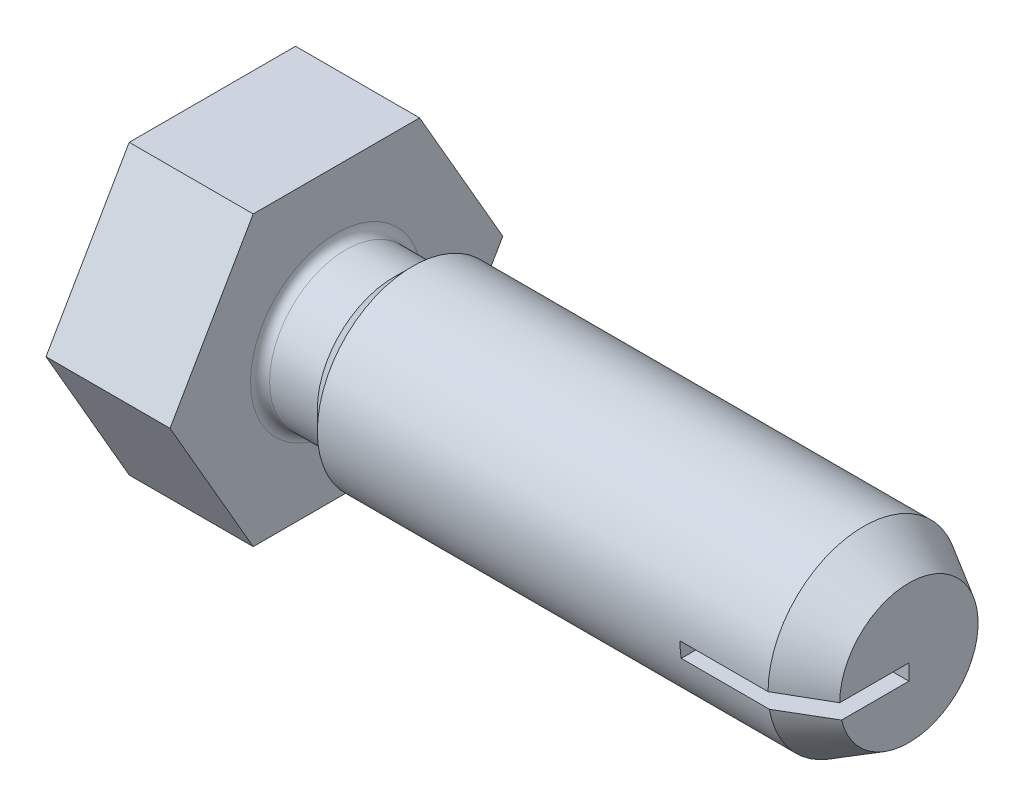
ISO-10303-21;
HEADER;
FILE_DESCRIPTION(('STEP AP214'),'2;1');
FILE_NAME('part.step','',(''),(''),'','','');
FILE_SCHEMA(('AUTOMOTIVE_DESIGN { 1 0 10303 214 1 1 1 1 }'));
ENDSEC;
DATA;
#1=APPLICATION_CONTEXT('core data for automotive mechanical design processes');
#2=APPLICATION_PROTOCOL_DEFINITION('international standard','automotive_design',2000,#1);
#3=PRODUCT_CONTEXT('',#1,'mechanical');
#4=PRODUCT('Part','Part','',(#3));
#5=PRODUCT_RELATED_PRODUCT_CATEGORY('part','',(#4));
#6=PRODUCT_DEFINITION_FORMATION('','',#4);
#7=PRODUCT_DEFINITION_CONTEXT('part definition',#1,'design');
#8=PRODUCT_DEFINITION('design','',#6,#7);
#9=PRODUCT_DEFINITION_SHAPE('','',#8);
#10=(LENGTH_UNIT() NAMED_UNIT(*) SI_UNIT(.MILLI.,.METRE.));
#11=(NAMED_UNIT(*) PLANE_ANGLE_UNIT() SI_UNIT($,.RADIAN.));
#12=(NAMED_UNIT(*) SI_UNIT($,.STERADIAN.) SOLID_ANGLE_UNIT());
#13=UNCERTAINTY_MEASURE_WITH_UNIT(LENGTH_MEASURE(1.E-05),#10,'distance_accuracy_value','');
#14=(GEOMETRIC_REPRESENTATION_CONTEXT(3) GLOBAL_UNCERTAINTY_ASSIGNED_CONTEXT((#13)) GLOBAL_UNIT_ASSIGNED_CONTEXT((#10,
#11,#12)) REPRESENTATION_CONTEXT('',''));
#15=CARTESIAN_POINT('',(0.,0.,0.));
#16=DIRECTION('',(0.,0.,1.));
#17=DIRECTION('',(1.,0.,0.));
#18=AXIS2_PLACEMENT_3D('',#15,#16,#17);
#19=CARTESIAN_POINT('',(0.,0.,0.));
#20=DIRECTION('',(-1.,0.,0.));
#21=DIRECTION('',(0.,0.,1.));
#22=AXIS2_PLACEMENT_3D('',#19,#20,#21);
#23=CYLINDRICAL_SURFACE('',#22,1.);
#24=CARTESIAN_POINT('',(0.8,0.,0.));
#25=DIRECTION('',(-1.,0.,0.));
#26=DIRECTION('',(0.,0.,1.));
#27=AXIS2_PLACEMENT_3D('',#24,#25,#26);
#28=CIRCLE('',#27,1.);
#29=CARTESIAN_POINT('',(0.8,0.,1.));
#30=VERTEX_POINT('',#29);
#31=EDGE_CURVE('E233',#30,#30,#28,.T.);
#32=ORIENTED_EDGE('',*,*,#31,.F.);
#33=EDGE_LOOP('',(#32));
#34=FACE_BOUND('',#33,.T.);
#35=DIRECTION('',(-1.,0.,0.));
#36=VECTOR('',#35,1.);
#37=CARTESIAN_POINT('',(0.,0.,1.));
#38=LINE('',#37,#36);
#39=CARTESIAN_POINT('',(5.52368602791855,0.,1.));
#40=VERTEX_POINT('',#39);
#41=CARTESIAN_POINT('',(4.6,0.,1.));
#42=VERTEX_POINT('',#41);
#43=EDGE_CURVE('E266',#40,#42,#38,.T.);
#44=ORIENTED_EDGE('',*,*,#43,.F.);
#45=CARTESIAN_POINT('',(5.52368602791855,0.,0.));
#46=DIRECTION('',(-1.,0.,0.));
#47=DIRECTION('',(0.,0.,1.));
#48=AXIS2_PLACEMENT_3D('',#45,#46,#47);
#49=CIRCLE('',#48,1.);
#50=CARTESIAN_POINT('',(5.52368602791855,-0.166666666666667,0.986013297183269));
#51=VERTEX_POINT('',#50);
#52=EDGE_CURVE('E265',#40,#51,#49,.T.);
#53=ORIENTED_EDGE('',*,*,#52,.T.);
#54=DIRECTION('',(-1.,0.,0.));
#55=VECTOR('',#54,1.);
#56=CARTESIAN_POINT('',(0.,-0.166666666666668,0.986013297183269));
#57=LINE('',#56,#55);
#58=CARTESIAN_POINT('',(4.6,-0.166666666666667,0.986013297183269));
#59=VERTEX_POINT('',#58);
#60=EDGE_CURVE('E267',#59,#51,#57,.F.);
#61=ORIENTED_EDGE('',*,*,#60,.F.);
#62=CARTESIAN_POINT('',(4.6,0.,0.));
#63=DIRECTION('',(1.,0.,0.));
#64=DIRECTION('',(0.,0.,-1.));
#65=AXIS2_PLACEMENT_3D('',#62,#63,#64);
#66=CIRCLE('',#65,1.);
#67=EDGE_CURVE('E98',#42,#59,#66,.T.);
#68=ORIENTED_EDGE('',*,*,#67,.F.);
#69=EDGE_LOOP('',(#44,#53,#61,#68));
#70=FACE_BOUND('',#69,.T.);
#71=ADVANCED_FACE('F124',(#34,#70),#23,.T.);
#72=CARTESIAN_POINT('',(5.52368602791855,0.,0.));
#73=DIRECTION('',(-1.,0.,0.));
#74=DIRECTION('',(0.,0.,1.));
#75=AXIS2_PLACEMENT_3D('',#72,#73,#74);
#76=CONICAL_SURFACE('',#75,1.,0.523598775598293);
#77=ORIENTED_EDGE('',*,*,#52,.F.);
#78=DIRECTION('',(-0.866025403784442,0.,0.499999999999995));
#79=VECTOR('',#78,1.);
#80=CARTESIAN_POINT('',(7.25573683548745,0.,0.));
#81=LINE('',#80,#79);
#82=CARTESIAN_POINT('',(6.,0.,0.725));
#83=VERTEX_POINT('',#82);
#84=EDGE_CURVE('E246',#40,#83,#81,.F.);
#85=ORIENTED_EDGE('',*,*,#84,.T.);
#86=CARTESIAN_POINT('',(6.,0.,0.));
#87=DIRECTION('',(-1.,0.,0.));
#88=DIRECTION('',(0.,0.,1.));
#89=AXIS2_PLACEMENT_3D('',#86,#87,#88);
#90=CIRCLE('',#89,0.725);
#91=CARTESIAN_POINT('',(6.,-0.166666666666667,0.705582895358314));
#92=VERTEX_POINT('',#91);
#93=EDGE_CURVE('E263',#83,#92,#90,.T.);
#94=ORIENTED_EDGE('',*,*,#93,.T.);
#95=CARTESIAN_POINT('',(6.80158381332156,-0.166666666666667,0.202420053526556));
#96=CARTESIAN_POINT('',(6.78988783202904,-0.166666666666667,0.211160466548661));
#97=CARTESIAN_POINT('',(6.77809025351936,-0.166666666666667,0.219762178615644));
#98=CARTESIAN_POINT('',(6.75433894019539,-0.166666666666667,0.236744395333112));
#99=CARTESIAN_POINT('',(6.74238522545202,-0.166666666666667,0.24512492800532));
#100=CARTESIAN_POINT('',(6.70636354341486,-0.166666666666667,0.27001702074862));
#101=CARTESIAN_POINT('',(6.68212753980992,-0.166666666666667,0.286284562967418));
#102=CARTESIAN_POINT('',(6.63340179258793,-0.166666666666667,0.318405310598193));
#103=CARTESIAN_POINT('',(6.60891218022306,-0.166666666666667,0.334258716708567));
#104=CARTESIAN_POINT('',(6.55975519749879,-0.166666666666667,0.365692570195777));
#105=CARTESIAN_POINT('',(6.53508780915903,-0.166666666666667,0.381272989399869));
#106=CARTESIAN_POINT('',(6.4639391094645,-0.166666666666667,0.425830715171767));
#107=CARTESIAN_POINT('',(6.41730791747779,-0.166666666666667,0.454568202998024));
#108=CARTESIAN_POINT('',(6.32381363437533,-0.166666666666667,0.511663876308537));
#109=CARTESIAN_POINT('',(6.27695053810779,-0.166666666666667,0.540022053314042));
#110=CARTESIAN_POINT('',(6.13610967036877,-0.166666666666667,0.624768530387811));
#111=CARTESIAN_POINT('',(6.04192005634867,-0.166666666666667,0.68080432180917));
#112=CARTESIAN_POINT('',(5.80311464815558,-0.166666666666667,0.822157213235217));
#113=CARTESIAN_POINT('',(5.6583320552326,-0.166666666666667,0.907191272129434));
#114=CARTESIAN_POINT('',(5.4410388744482,-0.166666666666667,1.03439645779868));
#115=CARTESIAN_POINT('',(5.36861884543355,-0.166666666666667,1.07672255711247));
#116=CARTESIAN_POINT('',(5.22373306050023,-0.166666666666667,1.16129606629587));
#117=CARTESIAN_POINT('',(5.15126730468176,-0.166666666666667,1.2035434763371));
#118=CARTESIAN_POINT('',(5.07878578161591,-0.166666666666667,1.24576382962675));
#119=B_SPLINE_CURVE_WITH_KNOTS('',3,(#95,#96,#97,#98,#99,#100,#101,#102,#103,#104,#105,#106,
#107,#108,#109,#110,#111,#112,#113,#114,#115,#116,#117,#118),.UNSPECIFIED.,.F.,.F.,(4,2,2,2,2,2,
2,2,2,2,2,4),(0.,0.0437997583052368,0.0875939406187669,0.175154441441493,0.262671690481115,
0.35019791888352,0.514519420031463,0.678844588147894,1.00763489196674,1.51135489439912,
1.7630003291903,2.01464521454735),.UNSPECIFIED.);
#120=EDGE_CURVE('E458',#92,#51,#119,.T.);
#121=ORIENTED_EDGE('',*,*,#120,.T.);
#122=EDGE_LOOP('',(#77,#85,#94,#121));
#123=FACE_BOUND('',#122,.T.);
#124=ADVANCED_FACE('F260',(#123),#76,.T.);
#125=CARTESIAN_POINT('',(6.,1.,0.));
#126=DIRECTION('',(-1.,0.,0.));
#127=DIRECTION('',(0.,0.,1.));
#128=AXIS2_PLACEMENT_3D('',#125,#126,#127);
#129=PLANE('',#128);
#130=DIRECTION('',(0.,0.,1.));
#131=VECTOR('',#130,1.);
#132=CARTESIAN_POINT('',(6.,0.,0.));
#133=LINE('',#132,#131);
#134=CARTESIAN_POINT('',(6.,0.,0.));
#135=VERTEX_POINT('',#134);
#136=EDGE_CURVE('E132',#135,#83,#133,.T.);
#137=ORIENTED_EDGE('',*,*,#136,.F.);
#138=DIRECTION('',(0.,1.,0.));
#139=VECTOR('',#138,1.);
#140=CARTESIAN_POINT('',(6.,0.,0.));
#141=LINE('',#140,#139);
#142=CARTESIAN_POINT('',(6.,-0.166666666666667,0.));
#143=VERTEX_POINT('',#142);
#144=EDGE_CURVE('E492',#143,#135,#141,.T.);
#145=ORIENTED_EDGE('',*,*,#144,.F.);
#146=DIRECTION('',(0.,0.,-1.));
#147=VECTOR('',#146,1.);
#148=CARTESIAN_POINT('',(6.,-0.166666666666667,0.));
#149=LINE('',#148,#147);
#150=EDGE_CURVE('E236',#92,#143,#149,.T.);
#151=ORIENTED_EDGE('',*,*,#150,.F.);
#152=ORIENTED_EDGE('',*,*,#93,.F.);
#153=EDGE_LOOP('',(#137,#145,#151,#152));
#154=FACE_BOUND('',#153,.T.);
#155=ADVANCED_FACE('F270',(#154),#129,.F.);
#156=CARTESIAN_POINT('',(0.8,0.,0.));
#157=DIRECTION('',(1.,0.,0.));
#158=DIRECTION('',(0.,0.,-1.));
#159=AXIS2_PLACEMENT_3D('',#156,#157,#158);
#160=CONICAL_SURFACE('',#159,1.,0.78539816339745);
#161=CARTESIAN_POINT('',(0.600000000000001,0.,0.));
#162=DIRECTION('',(-1.,0.,0.));
#163=DIRECTION('',(0.,0.,1.));
#164=AXIS2_PLACEMENT_3D('',#161,#162,#163);
#165=CIRCLE('',#164,0.8);
#166=CARTESIAN_POINT('',(0.600000000000001,0.,0.8));
#167=VERTEX_POINT('',#166);
#168=EDGE_CURVE('E230',#167,#167,#165,.T.);
#169=ORIENTED_EDGE('',*,*,#168,.F.);
#170=EDGE_LOOP('',(#169));
#171=FACE_BOUND('',#170,.T.);
#172=ORIENTED_EDGE('',*,*,#31,.T.);
#173=EDGE_LOOP('',(#172));
#174=FACE_BOUND('',#173,.T.);
#175=ADVANCED_FACE('F324',(#171,#174),#160,.T.);
#176=CARTESIAN_POINT('',(0.,0.,0.));
#177=DIRECTION('',(-1.,0.,0.));
#178=DIRECTION('',(0.,0.,1.));
#179=AXIS2_PLACEMENT_3D('',#176,#177,#178);
#180=CYLINDRICAL_SURFACE('',#179,0.8);
#181=CARTESIAN_POINT('',(0.1,0.,0.));
#182=DIRECTION('',(-1.,0.,0.));
#183=DIRECTION('',(0.,0.,1.));
#184=AXIS2_PLACEMENT_3D('',#181,#182,#183);
#185=CIRCLE('',#184,0.8);
#186=CARTESIAN_POINT('',(0.1,0.,0.8));
#187=VERTEX_POINT('',#186);
#188=EDGE_CURVE('E226',#187,#187,#185,.T.);
#189=ORIENTED_EDGE('',*,*,#188,.F.);
#190=EDGE_LOOP('',(#189));
#191=FACE_BOUND('',#190,.T.);
#192=ORIENTED_EDGE('',*,*,#168,.T.);
#193=EDGE_LOOP('',(#192));
#194=FACE_BOUND('',#193,.T.);
#195=ADVANCED_FACE('F330',(#191,#194),#180,.T.);
#196=CARTESIAN_POINT('',(0.1,0.,0.));
#197=DIRECTION('',(-1.,0.,0.));
#198=DIRECTION('',(0.,0.,1.));
#199=AXIS2_PLACEMENT_3D('',#196,#197,#198);
#200=TOROIDAL_SURFACE('',#199,0.9,0.1);
#201=CARTESIAN_POINT('',(0.,0.,0.));
#202=DIRECTION('',(-1.,0.,0.));
#203=DIRECTION('',(0.,0.,1.));
#204=AXIS2_PLACEMENT_3D('',#201,#202,#203);
#205=CIRCLE('',#204,0.9);
#206=CARTESIAN_POINT('',(0.,0.,0.9));
#207=VERTEX_POINT('',#206);
#208=EDGE_CURVE('E223',#207,#207,#205,.T.);
#209=ORIENTED_EDGE('',*,*,#208,.F.);
#210=EDGE_LOOP('',(#209));
#211=FACE_BOUND('',#210,.T.);
#212=ORIENTED_EDGE('',*,*,#188,.T.);
#213=EDGE_LOOP('',(#212));
#214=FACE_BOUND('',#213,.T.);
#215=ADVANCED_FACE('F335',(#211,#214),#200,.F.);
#216=CARTESIAN_POINT('',(0.,1.51,0.));
#217=DIRECTION('',(-1.,0.,0.));
#218=DIRECTION('',(0.,0.,1.));
#219=AXIS2_PLACEMENT_3D('',#216,#217,#218);
#220=PLANE('',#219);
#221=DIRECTION('',(0.,0.866025403784439,0.5));
#222=VECTOR('',#221,1.);
#223=CARTESIAN_POINT('',(0.,0.755,-1.3076983597145));
#224=LINE('',#223,#222);
#225=CARTESIAN_POINT('',(0.,0.,-1.74359781295267));
#226=VERTEX_POINT('',#225);
#227=CARTESIAN_POINT('',(0.,1.51,-0.871798906476335));
#228=VERTEX_POINT('',#227);
#229=EDGE_CURVE('E148',#226,#228,#224,.T.);
#230=ORIENTED_EDGE('',*,*,#229,.T.);
#231=DIRECTION('',(0.,0.,1.));
#232=VECTOR('',#231,1.);
#233=CARTESIAN_POINT('',(0.,1.51,0.));
#234=LINE('',#233,#232);
#235=CARTESIAN_POINT('',(0.,1.51,0.871798906476335));
#236=VERTEX_POINT('',#235);
#237=EDGE_CURVE('E282',#228,#236,#234,.T.);
#238=ORIENTED_EDGE('',*,*,#237,.T.);
#239=DIRECTION('',(0.,-0.866025403784439,0.5));
#240=VECTOR('',#239,1.);
#241=CARTESIAN_POINT('',(0.,0.,1.74359781295267));
#242=LINE('',#241,#240);
#243=CARTESIAN_POINT('',(0.,0.,1.74359781295267));
#244=VERTEX_POINT('',#243);
#245=EDGE_CURVE('E203',#236,#244,#242,.T.);
#246=ORIENTED_EDGE('',*,*,#245,.T.);
#247=DIRECTION('',(0.,-0.866025403784439,-0.5));
#248=VECTOR('',#247,1.);
#249=CARTESIAN_POINT('',(0.,-1.51,0.871798906476335));
#250=LINE('',#249,#248);
#251=CARTESIAN_POINT('',(0.,-1.51,0.871798906476335));
#252=VERTEX_POINT('',#251);
#253=EDGE_CURVE('E197',#244,#252,#250,.T.);
#254=ORIENTED_EDGE('',*,*,#253,.T.);
#255=DIRECTION('',(0.,0.,-1.));
#256=VECTOR('',#255,1.);
#257=CARTESIAN_POINT('',(0.,-1.51,-0.871798906476334));
#258=LINE('',#257,#256);
#259=CARTESIAN_POINT('',(0.,-1.51,-0.871798906476334));
#260=VERTEX_POINT('',#259);
#261=EDGE_CURVE('E187',#252,#260,#258,.T.);
#262=ORIENTED_EDGE('',*,*,#261,.T.);
#263=DIRECTION('',(0.,0.866025403784439,-0.5));
#264=VECTOR('',#263,1.);
#265=CARTESIAN_POINT('',(0.,-0.755,-1.3076983597145));
#266=LINE('',#265,#264);
#267=EDGE_CURVE('E227',#260,#226,#266,.T.);
#268=ORIENTED_EDGE('',*,*,#267,.T.);
#269=EDGE_LOOP('',(#230,#238,#246,#254,#262,#268));
#270=FACE_BOUND('',#269,.T.);
#271=ORIENTED_EDGE('',*,*,#208,.T.);
#272=EDGE_LOOP('',(#271));
#273=FACE_BOUND('',#272,.T.);
#274=ADVANCED_FACE('F200',(#270,#273),#220,.F.);
#275=CARTESIAN_POINT('',(4.61312619958888,-0.755,-1.3076983597145));
#276=DIRECTION('',(0.,-0.5,-0.866025403784438));
#277=DIRECTION('',(0.,0.866025403784439,-0.5));
#278=AXIS2_PLACEMENT_3D('',#275,#276,#277);
#279=PLANE('',#278);
#280=DIRECTION('',(-1.,0.,0.));
#281=VECTOR('',#280,1.);
#282=CARTESIAN_POINT('',(4.61312619958888,-1.51,-0.871798906476334));
#283=LINE('',#282,#281);
#284=CARTESIAN_POINT('',(-1.3,-1.51,-0.871798906476334));
#285=VERTEX_POINT('',#284);
#286=EDGE_CURVE('E195',#260,#285,#283,.T.);
#287=ORIENTED_EDGE('',*,*,#286,.T.);
#288=DIRECTION('',(0.,-0.866025403784439,0.5));
#289=VECTOR('',#288,1.);
#290=CARTESIAN_POINT('',(-1.3,-0.755,-1.3076983597145));
#291=LINE('',#290,#289);
#292=CARTESIAN_POINT('',(-1.3,0.,-1.74359781295267));
#293=VERTEX_POINT('',#292);
#294=EDGE_CURVE('E281',#293,#285,#291,.T.);
#295=ORIENTED_EDGE('',*,*,#294,.F.);
#296=DIRECTION('',(-1.,0.,0.));
#297=VECTOR('',#296,1.);
#298=CARTESIAN_POINT('',(4.61312619958888,0.,-1.74359781295267));
#299=LINE('',#298,#297);
#300=EDGE_CURVE('E278',#226,#293,#299,.T.);
#301=ORIENTED_EDGE('',*,*,#300,.F.);
#302=ORIENTED_EDGE('',*,*,#267,.F.);
#303=EDGE_LOOP('',(#287,#295,#301,#302));
#304=FACE_BOUND('',#303,.T.);
#305=ADVANCED_FACE('F297',(#304),#279,.T.);
#306=CARTESIAN_POINT('',(4.61312619958888,0.755,-1.3076983597145));
#307=DIRECTION('',(0.,0.5,-0.866025403784438));
#308=DIRECTION('',(0.,0.866025403784439,0.5));
#309=AXIS2_PLACEMENT_3D('',#306,#307,#308);
#310=PLANE('',#309);
#311=ORIENTED_EDGE('',*,*,#300,.T.);
#312=DIRECTION('',(0.,-0.866025403784439,-0.5));
#313=VECTOR('',#312,1.);
#314=CARTESIAN_POINT('',(-1.3,0.755,-1.3076983597145));
#315=LINE('',#314,#313);
#316=CARTESIAN_POINT('',(-1.3,1.51,-0.871798906476335));
#317=VERTEX_POINT('',#316);
#318=EDGE_CURVE('E279',#317,#293,#315,.T.);
#319=ORIENTED_EDGE('',*,*,#318,.F.);
#320=DIRECTION('',(-1.,0.,0.));
#321=VECTOR('',#320,1.);
#322=CARTESIAN_POINT('',(4.61312619958888,1.51,-0.871798906476335));
#323=LINE('',#322,#321);
#324=EDGE_CURVE('E287',#228,#317,#323,.T.);
#325=ORIENTED_EDGE('',*,*,#324,.F.);
#326=ORIENTED_EDGE('',*,*,#229,.F.);
#327=EDGE_LOOP('',(#311,#319,#325,#326));
#328=FACE_BOUND('',#327,.T.);
#329=ADVANCED_FACE('F299',(#328),#310,.T.);
#330=CARTESIAN_POINT('',(4.61312619958888,1.51,0.));
#331=DIRECTION('',(0.,1.,0.));
#332=DIRECTION('',(0.,0.,1.));
#333=AXIS2_PLACEMENT_3D('',#330,#331,#332);
#334=PLANE('',#333);
#335=ORIENTED_EDGE('',*,*,#324,.T.);
#336=DIRECTION('',(0.,0.,-1.));
#337=VECTOR('',#336,1.);
#338=CARTESIAN_POINT('',(-1.3,1.51,0.));
#339=LINE('',#338,#337);
#340=CARTESIAN_POINT('',(-1.3,1.51,0.871798906476335));
#341=VERTEX_POINT('',#340);
#342=EDGE_CURVE('E222',#341,#317,#339,.T.);
#343=ORIENTED_EDGE('',*,*,#342,.F.);
#344=DIRECTION('',(-1.,0.,0.));
#345=VECTOR('',#344,1.);
#346=CARTESIAN_POINT('',(4.61312619958888,1.51,0.871798906476335));
#347=LINE('',#346,#345);
#348=EDGE_CURVE('E211',#236,#341,#347,.T.);
#349=ORIENTED_EDGE('',*,*,#348,.F.);
#350=ORIENTED_EDGE('',*,*,#237,.F.);
#351=EDGE_LOOP('',(#335,#343,#349,#350));
#352=FACE_BOUND('',#351,.T.);
#353=ADVANCED_FACE('F301',(#352),#334,.T.);
#354=CARTESIAN_POINT('',(4.61312619958888,-1.51,-0.871798906476334));
#355=DIRECTION('',(0.,-1.,0.));
#356=DIRECTION('',(0.,0.,-1.));
#357=AXIS2_PLACEMENT_3D('',#354,#355,#356);
#358=PLANE('',#357);
#359=DIRECTION('',(-1.,0.,0.));
#360=VECTOR('',#359,1.);
#361=CARTESIAN_POINT('',(4.61312619958888,-1.51,0.871798906476335));
#362=LINE('',#361,#360);
#363=CARTESIAN_POINT('',(-1.3,-1.51,0.871798906476335));
#364=VERTEX_POINT('',#363);
#365=EDGE_CURVE('E192',#252,#364,#362,.T.);
#366=ORIENTED_EDGE('',*,*,#365,.T.);
#367=DIRECTION('',(0.,0.,1.));
#368=VECTOR('',#367,1.);
#369=CARTESIAN_POINT('',(-1.3,-1.51,-0.871798906476334));
#370=LINE('',#369,#368);
#371=EDGE_CURVE('E214',#285,#364,#370,.T.);
#372=ORIENTED_EDGE('',*,*,#371,.F.);
#373=ORIENTED_EDGE('',*,*,#286,.F.);
#374=ORIENTED_EDGE('',*,*,#261,.F.);
#375=EDGE_LOOP('',(#366,#372,#373,#374));
#376=FACE_BOUND('',#375,.T.);
#377=ADVANCED_FACE('F189',(#376),#358,.T.);
#378=CARTESIAN_POINT('',(4.61312619958888,-1.51,0.871798906476335));
#379=DIRECTION('',(0.,-0.5,0.866025403784439));
#380=DIRECTION('',(0.,-0.866025403784439,-0.5));
#381=AXIS2_PLACEMENT_3D('',#378,#379,#380);
#382=PLANE('',#381);
#383=DIRECTION('',(-1.,0.,0.));
#384=VECTOR('',#383,1.);
#385=CARTESIAN_POINT('',(4.61312619958888,0.,1.74359781295267));
#386=LINE('',#385,#384);
#387=CARTESIAN_POINT('',(-1.3,0.,1.74359781295267));
#388=VERTEX_POINT('',#387);
#389=EDGE_CURVE('E219',#244,#388,#386,.T.);
#390=ORIENTED_EDGE('',*,*,#389,.T.);
#391=DIRECTION('',(0.,0.866025403784439,0.5));
#392=VECTOR('',#391,1.);
#393=CARTESIAN_POINT('',(-1.3,-1.51,0.871798906476335));
#394=LINE('',#393,#392);
#395=EDGE_CURVE('E209',#364,#388,#394,.T.);
#396=ORIENTED_EDGE('',*,*,#395,.F.);
#397=ORIENTED_EDGE('',*,*,#365,.F.);
#398=ORIENTED_EDGE('',*,*,#253,.F.);
#399=EDGE_LOOP('',(#390,#396,#397,#398));
#400=FACE_BOUND('',#399,.T.);
#401=ADVANCED_FACE('F208',(#400),#382,.T.);
#402=CARTESIAN_POINT('',(4.61312619958888,0.,1.74359781295267));
#403=DIRECTION('',(0.,0.5,0.866025403784438));
#404=DIRECTION('',(0.,-0.866025403784439,0.5));
#405=AXIS2_PLACEMENT_3D('',#402,#403,#404);
#406=PLANE('',#405);
#407=DIRECTION('',(0.,0.866025403784439,-0.5));
#408=VECTOR('',#407,1.);
#409=CARTESIAN_POINT('',(-1.3,0.,1.74359781295267));
#410=LINE('',#409,#408);
#411=EDGE_CURVE('E272',#388,#341,#410,.T.);
#412=ORIENTED_EDGE('',*,*,#411,.F.);
#413=ORIENTED_EDGE('',*,*,#389,.F.);
#414=ORIENTED_EDGE('',*,*,#245,.F.);
#415=ORIENTED_EDGE('',*,*,#348,.T.);
#416=EDGE_LOOP('',(#412,#413,#414,#415));
#417=FACE_BOUND('',#416,.T.);
#418=ADVANCED_FACE('F303',(#417),#406,.T.);
#419=CARTESIAN_POINT('',(-1.3,1.51,0.));
#420=DIRECTION('',(1.,0.,0.));
#421=DIRECTION('',(0.,0.,-1.));
#422=AXIS2_PLACEMENT_3D('',#419,#420,#421);
#423=PLANE('',#422);
#424=CARTESIAN_POINT('',(-1.3,0.,0.));
#425=DIRECTION('',(-1.,0.,0.));
#426=DIRECTION('',(0.,0.,1.));
#427=AXIS2_PLACEMENT_3D('',#424,#425,#426);
#428=CIRCLE('',#427,1.208);
#429=CARTESIAN_POINT('',(-1.3,0.,1.208));
#430=VERTEX_POINT('',#429);
#431=EDGE_CURVE('E495',#430,#430,#428,.T.);
#432=ORIENTED_EDGE('',*,*,#431,.F.);
#433=EDGE_LOOP('',(#432));
#434=FACE_BOUND('',#433,.T.);
#435=ORIENTED_EDGE('',*,*,#395,.T.);
#436=ORIENTED_EDGE('',*,*,#411,.T.);
#437=ORIENTED_EDGE('',*,*,#342,.T.);
#438=ORIENTED_EDGE('',*,*,#318,.T.);
#439=ORIENTED_EDGE('',*,*,#294,.T.);
#440=ORIENTED_EDGE('',*,*,#371,.T.);
#441=EDGE_LOOP('',(#435,#436,#437,#438,#439,#440));
#442=FACE_BOUND('',#441,.T.);
#443=ADVANCED_FACE('F126',(#434,#442),#423,.F.);
#444=CARTESIAN_POINT('',(4.6,0.,1.74359781295267));
#445=DIRECTION('',(1.,0.,0.));
#446=DIRECTION('',(0.,0.,-1.));
#447=AXIS2_PLACEMENT_3D('',#444,#445,#446);
#448=PLANE('',#447);
#449=ORIENTED_EDGE('',*,*,#67,.T.);
#450=DIRECTION('',(0.,0.,-1.));
#451=VECTOR('',#450,1.);
#452=CARTESIAN_POINT('',(4.6,-0.166666666666667,1.74359781295267));
#453=LINE('',#452,#451);
#454=CARTESIAN_POINT('',(4.6,-0.166666666666667,0.));
#455=VERTEX_POINT('',#454);
#456=EDGE_CURVE('E478',#59,#455,#453,.T.);
#457=ORIENTED_EDGE('',*,*,#456,.T.);
#458=DIRECTION('',(0.,-1.,0.));
#459=VECTOR('',#458,1.);
#460=CARTESIAN_POINT('',(4.6,0.,0.));
#461=LINE('',#460,#459);
#462=CARTESIAN_POINT('',(4.6,0.,0.));
#463=VERTEX_POINT('',#462);
#464=EDGE_CURVE('E477',#463,#455,#461,.T.);
#465=ORIENTED_EDGE('',*,*,#464,.F.);
#466=DIRECTION('',(0.,0.,-1.));
#467=VECTOR('',#466,1.);
#468=CARTESIAN_POINT('',(4.6,0.,1.74359781295267));
#469=LINE('',#468,#467);
#470=EDGE_CURVE('E465',#42,#463,#469,.T.);
#471=ORIENTED_EDGE('',*,*,#470,.F.);
#472=EDGE_LOOP('',(#449,#457,#465,#471));
#473=FACE_BOUND('',#472,.T.);
#474=ADVANCED_FACE('F310',(#473),#448,.T.);
#475=CARTESIAN_POINT('',(6.,0.,1.74359781295267));
#476=DIRECTION('',(0.,-1.,0.));
#477=DIRECTION('',(1.,0.,0.));
#478=AXIS2_PLACEMENT_3D('',#475,#476,#477);
#479=PLANE('',#478);
#480=ORIENTED_EDGE('',*,*,#43,.T.);
#481=ORIENTED_EDGE('',*,*,#470,.T.);
#482=DIRECTION('',(-1.,0.,0.));
#483=VECTOR('',#482,1.);
#484=CARTESIAN_POINT('',(6.,0.,0.));
#485=LINE('',#484,#483);
#486=EDGE_CURVE('E251',#135,#463,#485,.T.);
#487=ORIENTED_EDGE('',*,*,#486,.F.);
#488=ORIENTED_EDGE('',*,*,#136,.T.);
#489=ORIENTED_EDGE('',*,*,#84,.F.);
#490=EDGE_LOOP('',(#480,#481,#487,#488,#489));
#491=FACE_BOUND('',#490,.T.);
#492=ADVANCED_FACE('F245',(#491),#479,.T.);
#493=CARTESIAN_POINT('',(6.,-0.166666666666667,1.74359781295267));
#494=DIRECTION('',(0.,1.,0.));
#495=DIRECTION('',(-1.,0.,0.));
#496=AXIS2_PLACEMENT_3D('',#493,#494,#495);
#497=PLANE('',#496);
#498=ORIENTED_EDGE('',*,*,#60,.T.);
#499=ORIENTED_EDGE('',*,*,#120,.F.);
#500=ORIENTED_EDGE('',*,*,#150,.T.);
#501=DIRECTION('',(1.,0.,0.));
#502=VECTOR('',#501,1.);
#503=CARTESIAN_POINT('',(6.,-0.166666666666667,0.));
#504=LINE('',#503,#502);
#505=EDGE_CURVE('E139',#455,#143,#504,.T.);
#506=ORIENTED_EDGE('',*,*,#505,.F.);
#507=ORIENTED_EDGE('',*,*,#456,.F.);
#508=EDGE_LOOP('',(#498,#499,#500,#506,#507));
#509=FACE_BOUND('',#508,.T.);
#510=ADVANCED_FACE('F408',(#509),#497,.T.);
#511=CARTESIAN_POINT('',(6.,0.,0.));
#512=DIRECTION('',(0.,0.,-1.));
#513=DIRECTION('',(-1.,0.,0.));
#514=AXIS2_PLACEMENT_3D('',#511,#512,#513);
#515=PLANE('',#514);
#516=ORIENTED_EDGE('',*,*,#144,.T.);
#517=ORIENTED_EDGE('',*,*,#486,.T.);
#518=ORIENTED_EDGE('',*,*,#464,.T.);
#519=ORIENTED_EDGE('',*,*,#505,.T.);
#520=EDGE_LOOP('',(#516,#517,#518,#519));
#521=FACE_BOUND('',#520,.T.);
#522=ADVANCED_FACE('F416',(#521),#515,.F.);
#523=CARTESIAN_POINT('',(-1.04,0.,0.));
#524=DIRECTION('',(-1.,0.,0.));
#525=DIRECTION('',(0.,0.,1.));
#526=AXIS2_PLACEMENT_3D('',#523,#524,#525);
#527=CYLINDRICAL_SURFACE('',#526,1.208);
#528=CARTESIAN_POINT('',(-1.04,0.,0.));
#529=DIRECTION('',(-1.,0.,0.));
#530=DIRECTION('',(0.,0.,1.));
#531=AXIS2_PLACEMENT_3D('',#528,#529,#530);
#532=CIRCLE('',#531,1.208);
#533=CARTESIAN_POINT('',(-1.04,0.,1.208));
#534=VERTEX_POINT('',#533);
#535=EDGE_CURVE('E494',#534,#534,#532,.T.);
#536=ORIENTED_EDGE('',*,*,#535,.F.);
#537=EDGE_LOOP('',(#536));
#538=FACE_BOUND('',#537,.T.);
#539=ORIENTED_EDGE('',*,*,#431,.T.);
#540=EDGE_LOOP('',(#539));
#541=FACE_BOUND('',#540,.T.);
#542=ADVANCED_FACE('F426',(#538,#541),#527,.F.);
#543=CARTESIAN_POINT('',(-1.04,0.,0.));
#544=DIRECTION('',(-1.,0.,0.));
#545=DIRECTION('',(0.,0.,1.));
#546=AXIS2_PLACEMENT_3D('',#543,#544,#545);
#547=PLANE('',#546);
#548=ORIENTED_EDGE('',*,*,#535,.T.);
#549=EDGE_LOOP('',(#548));
#550=FACE_BOUND('',#549,.T.);
#551=ADVANCED_FACE('F441',(#550),#547,.T.);
#552=CLOSED_SHELL('',(#71,#124,#155,#175,#195,#215,#274,#305,#329,#353,#377,#401,#418,#443,#474,
#492,#510,#522,#542,#551));
#553=MANIFOLD_SOLID_BREP('B7',#552);
#554=ADVANCED_BREP_SHAPE_REPRESENTATION('',(#18,#553),#14);
#555=SHAPE_DEFINITION_REPRESENTATION(#9,#554);
ENDSEC;
END-ISO-10303-21;
